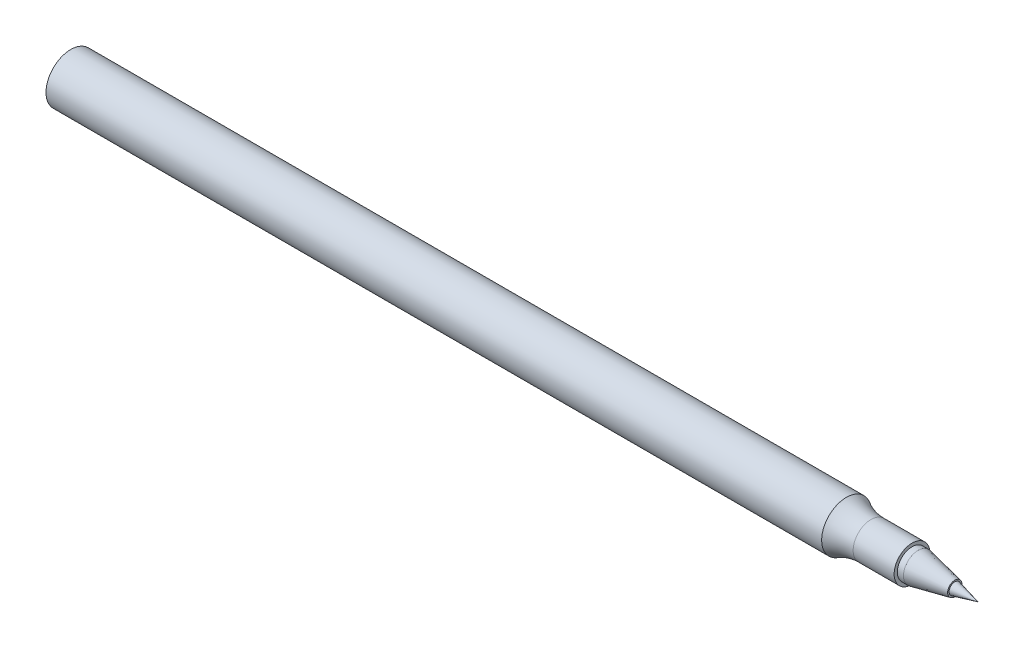
ISO-10303-21;
HEADER;
FILE_DESCRIPTION(('STEP AP214'),'2;1');
FILE_NAME('part.step','',(''),(''),'','','');
FILE_SCHEMA(('AUTOMOTIVE_DESIGN { 1 0 10303 214 1 1 1 1 }'));
ENDSEC;
DATA;
#1=APPLICATION_CONTEXT('core data for automotive mechanical design processes');
#2=APPLICATION_PROTOCOL_DEFINITION('international standard','automotive_design',2000,#1);
#3=PRODUCT_CONTEXT('',#1,'mechanical');
#4=PRODUCT('Part','Part','',(#3));
#5=PRODUCT_RELATED_PRODUCT_CATEGORY('part','',(#4));
#6=PRODUCT_DEFINITION_FORMATION('','',#4);
#7=PRODUCT_DEFINITION_CONTEXT('part definition',#1,'design');
#8=PRODUCT_DEFINITION('design','',#6,#7);
#9=PRODUCT_DEFINITION_SHAPE('','',#8);
#10=(LENGTH_UNIT() NAMED_UNIT(*) SI_UNIT(.MILLI.,.METRE.));
#11=(NAMED_UNIT(*) PLANE_ANGLE_UNIT() SI_UNIT($,.RADIAN.));
#12=(NAMED_UNIT(*) SI_UNIT($,.STERADIAN.) SOLID_ANGLE_UNIT());
#13=UNCERTAINTY_MEASURE_WITH_UNIT(LENGTH_MEASURE(1.E-05),#10,'distance_accuracy_value','');
#14=(GEOMETRIC_REPRESENTATION_CONTEXT(3) GLOBAL_UNCERTAINTY_ASSIGNED_CONTEXT((#13)) GLOBAL_UNIT_ASSIGNED_CONTEXT((#10,
#11,#12)) REPRESENTATION_CONTEXT('',''));
#15=CARTESIAN_POINT('',(0.,0.,0.));
#16=DIRECTION('',(0.,0.,1.));
#17=DIRECTION('',(1.,0.,0.));
#18=AXIS2_PLACEMENT_3D('',#15,#16,#17);
#19=CARTESIAN_POINT('',(58.6791795209404,0.,0.));
#20=DIRECTION('',(-1.,0.,0.));
#21=DIRECTION('',(0.,0.,1.));
#22=AXIS2_PLACEMENT_3D('',#19,#20,#21);
#23=CONICAL_SURFACE('',#22,0.,0.242622782833068);
#24=CARTESIAN_POINT('',(54.9847693869113,0.,0.));
#25=DIRECTION('',(-1.,0.,0.));
#26=DIRECTION('',(0.,0.,1.));
#27=AXIS2_PLACEMENT_3D('',#24,#25,#26);
#28=CIRCLE('',#27,0.914360397466367);
#29=CARTESIAN_POINT('',(54.9847693869113,0.,0.914360397466367));
#30=VERTEX_POINT('',#29);
#31=EDGE_CURVE('E11',#30,#30,#28,.T.);
#32=ORIENTED_EDGE('',*,*,#31,.F.);
#33=EDGE_LOOP('',(#32));
#34=FACE_BOUND('',#33,.T.);
#35=CARTESIAN_POINT('',(58.6791795209404,0.,0.));
#36=VERTEX_POINT('',#35);
#37=VERTEX_LOOP('',#36);
#38=FACE_BOUND('',#37,.T.);
#39=ADVANCED_FACE('F33',(#34,#38),#23,.T.);
#40=CARTESIAN_POINT('',(54.9847693869113,1.14594618396311,0.));
#41=DIRECTION('',(-1.,0.,0.));
#42=DIRECTION('',(0.,0.,1.));
#43=AXIS2_PLACEMENT_3D('',#40,#41,#42);
#44=PLANE('',#43);
#45=CARTESIAN_POINT('',(54.9847693869113,0.,0.));
#46=DIRECTION('',(-1.,0.,0.));
#47=DIRECTION('',(0.,0.,1.));
#48=AXIS2_PLACEMENT_3D('',#45,#46,#47);
#49=CIRCLE('',#48,1.14594618396311);
#50=CARTESIAN_POINT('',(54.9847693869113,0.,1.14594618396311));
#51=VERTEX_POINT('',#50);
#52=EDGE_CURVE('E39',#51,#51,#49,.T.);
#53=ORIENTED_EDGE('',*,*,#52,.F.);
#54=EDGE_LOOP('',(#53));
#55=FACE_BOUND('',#54,.T.);
#56=ORIENTED_EDGE('',*,*,#31,.T.);
#57=EDGE_LOOP('',(#56));
#58=FACE_BOUND('',#57,.T.);
#59=ADVANCED_FACE('F43',(#55,#58),#44,.F.);
#60=CARTESIAN_POINT('',(54.9847693869113,0.,0.));
#61=DIRECTION('',(-1.,0.,0.));
#62=DIRECTION('',(0.,0.,1.));
#63=AXIS2_PLACEMENT_3D('',#60,#61,#62);
#64=CONICAL_SURFACE('',#63,1.14594618396311,0.203180461761934);
#65=CARTESIAN_POINT('',(49.1429368511115,0.,0.));
#66=DIRECTION('',(-1.,0.,0.));
#67=DIRECTION('',(0.,0.,1.));
#68=AXIS2_PLACEMENT_3D('',#65,#66,#67);
#69=CIRCLE('',#68,2.3495);
#70=CARTESIAN_POINT('',(49.1429368511115,0.,2.3495));
#71=VERTEX_POINT('',#70);
#72=EDGE_CURVE('E101',#71,#71,#69,.T.);
#73=ORIENTED_EDGE('',*,*,#72,.F.);
#74=EDGE_LOOP('',(#73));
#75=FACE_BOUND('',#74,.T.);
#76=ORIENTED_EDGE('',*,*,#52,.T.);
#77=EDGE_LOOP('',(#76));
#78=FACE_BOUND('',#77,.T.);
#79=ADVANCED_FACE('F48',(#75,#78),#64,.T.);
#80=CARTESIAN_POINT('',(-85.9738204790596,0.,0.));
#81=DIRECTION('',(-1.,0.,0.));
#82=DIRECTION('',(0.,0.,1.));
#83=AXIS2_PLACEMENT_3D('',#80,#81,#82);
#84=CYLINDRICAL_SURFACE('',#83,2.3495);
#85=CARTESIAN_POINT('',(48.1635795209404,0.,0.));
#86=DIRECTION('',(-1.,0.,0.));
#87=DIRECTION('',(0.,0.,1.));
#88=AXIS2_PLACEMENT_3D('',#85,#86,#87);
#89=CIRCLE('',#88,2.3495);
#90=CARTESIAN_POINT('',(48.1635795209404,0.,2.3495));
#91=VERTEX_POINT('',#90);
#92=EDGE_CURVE('E98',#91,#91,#89,.T.);
#93=ORIENTED_EDGE('',*,*,#92,.F.);
#94=EDGE_LOOP('',(#93));
#95=FACE_BOUND('',#94,.T.);
#96=ORIENTED_EDGE('',*,*,#72,.T.);
#97=EDGE_LOOP('',(#96));
#98=FACE_BOUND('',#97,.T.);
#99=ADVANCED_FACE('F55',(#95,#98),#84,.T.);
#100=CARTESIAN_POINT('',(48.1635795209404,2.8575,0.));
#101=DIRECTION('',(-1.,0.,0.));
#102=DIRECTION('',(0.,0.,1.));
#103=AXIS2_PLACEMENT_3D('',#100,#101,#102);
#104=PLANE('',#103);
#105=CARTESIAN_POINT('',(48.1635795209404,0.,0.));
#106=DIRECTION('',(-1.,0.,0.));
#107=DIRECTION('',(0.,0.,1.));
#108=AXIS2_PLACEMENT_3D('',#105,#106,#107);
#109=CIRCLE('',#108,2.8575);
#110=CARTESIAN_POINT('',(48.1635795209404,0.,2.8575));
#111=VERTEX_POINT('',#110);
#112=EDGE_CURVE('E95',#111,#111,#109,.T.);
#113=ORIENTED_EDGE('',*,*,#112,.F.);
#114=EDGE_LOOP('',(#113));
#115=FACE_BOUND('',#114,.T.);
#116=ORIENTED_EDGE('',*,*,#92,.T.);
#117=EDGE_LOOP('',(#116));
#118=FACE_BOUND('',#117,.T.);
#119=ADVANCED_FACE('F62',(#115,#118),#104,.F.);
#120=CARTESIAN_POINT('',(-85.9738204790596,0.,0.));
#121=DIRECTION('',(-1.,0.,0.));
#122=DIRECTION('',(0.,0.,1.));
#123=AXIS2_PLACEMENT_3D('',#120,#121,#122);
#124=CYLINDRICAL_SURFACE('',#123,2.8575);
#125=CARTESIAN_POINT('',(41.6297116190565,0.,0.));
#126=DIRECTION('',(-1.,0.,0.));
#127=DIRECTION('',(0.,0.,1.));
#128=AXIS2_PLACEMENT_3D('',#125,#126,#127);
#129=CIRCLE('',#128,2.8575);
#130=CARTESIAN_POINT('',(41.6297116190565,0.,2.8575));
#131=VERTEX_POINT('',#130);
#132=EDGE_CURVE('E90',#131,#131,#129,.T.);
#133=ORIENTED_EDGE('',*,*,#132,.F.);
#134=EDGE_LOOP('',(#133));
#135=FACE_BOUND('',#134,.T.);
#136=ORIENTED_EDGE('',*,*,#112,.T.);
#137=EDGE_LOOP('',(#136));
#138=FACE_BOUND('',#137,.T.);
#139=ADVANCED_FACE('F66',(#135,#138),#124,.T.);
#140=CARTESIAN_POINT('',(41.6297116190565,0.,0.));
#141=DIRECTION('',(-1.,0.,0.));
#142=DIRECTION('',(0.,0.,1.));
#143=AXIS2_PLACEMENT_3D('',#140,#141,#142);
#144=TOROIDAL_SURFACE('',#143,10.4775,7.62);
#145=CARTESIAN_POINT('',(37.6987795209404,0.,0.));
#146=DIRECTION('',(-1.,0.,0.));
#147=DIRECTION('',(0.,0.,1.));
#148=AXIS2_PLACEMENT_3D('',#145,#146,#147);
#149=CIRCLE('',#148,3.94969999999999);
#150=CARTESIAN_POINT('',(37.6987795209404,0.,3.94969999999999));
#151=VERTEX_POINT('',#150);
#152=EDGE_CURVE('E87',#151,#151,#149,.T.);
#153=ORIENTED_EDGE('',*,*,#152,.F.);
#154=EDGE_LOOP('',(#153));
#155=FACE_BOUND('',#154,.T.);
#156=ORIENTED_EDGE('',*,*,#132,.T.);
#157=EDGE_LOOP('',(#156));
#158=FACE_BOUND('',#157,.T.);
#159=ADVANCED_FACE('F70',(#155,#158),#144,.F.);
#160=CARTESIAN_POINT('',(-85.9738204790596,0.,0.));
#161=DIRECTION('',(-1.,0.,0.));
#162=DIRECTION('',(0.,0.,1.));
#163=AXIS2_PLACEMENT_3D('',#160,#161,#162);
#164=CYLINDRICAL_SURFACE('',#163,3.94969999999999);
#165=CARTESIAN_POINT('',(-85.9738204790596,0.,0.));
#166=DIRECTION('',(-1.,0.,0.));
#167=DIRECTION('',(0.,0.,1.));
#168=AXIS2_PLACEMENT_3D('',#165,#166,#167);
#169=CIRCLE('',#168,3.94969999999999);
#170=CARTESIAN_POINT('',(-85.9738204790596,0.,3.94969999999999));
#171=VERTEX_POINT('',#170);
#172=EDGE_CURVE('E86',#171,#171,#169,.T.);
#173=ORIENTED_EDGE('',*,*,#172,.F.);
#174=EDGE_LOOP('',(#173));
#175=FACE_BOUND('',#174,.T.);
#176=ORIENTED_EDGE('',*,*,#152,.T.);
#177=EDGE_LOOP('',(#176));
#178=FACE_BOUND('',#177,.T.);
#179=ADVANCED_FACE('F74',(#175,#178),#164,.T.);
#180=CARTESIAN_POINT('',(-85.9738204790596,0.,0.));
#181=DIRECTION('',(1.,0.,0.));
#182=DIRECTION('',(0.,0.,-1.));
#183=AXIS2_PLACEMENT_3D('',#180,#181,#182);
#184=PLANE('',#183);
#185=ORIENTED_EDGE('',*,*,#172,.T.);
#186=EDGE_LOOP('',(#185));
#187=FACE_BOUND('',#186,.T.);
#188=ADVANCED_FACE('F78',(#187),#184,.F.);
#189=CLOSED_SHELL('',(#39,#59,#79,#99,#119,#139,#159,#179,#188));
#190=MANIFOLD_SOLID_BREP('B2',#189);
#191=ADVANCED_BREP_SHAPE_REPRESENTATION('',(#18,#190),#14);
#192=SHAPE_DEFINITION_REPRESENTATION(#9,#191);
ENDSEC;
END-ISO-10303-21;
